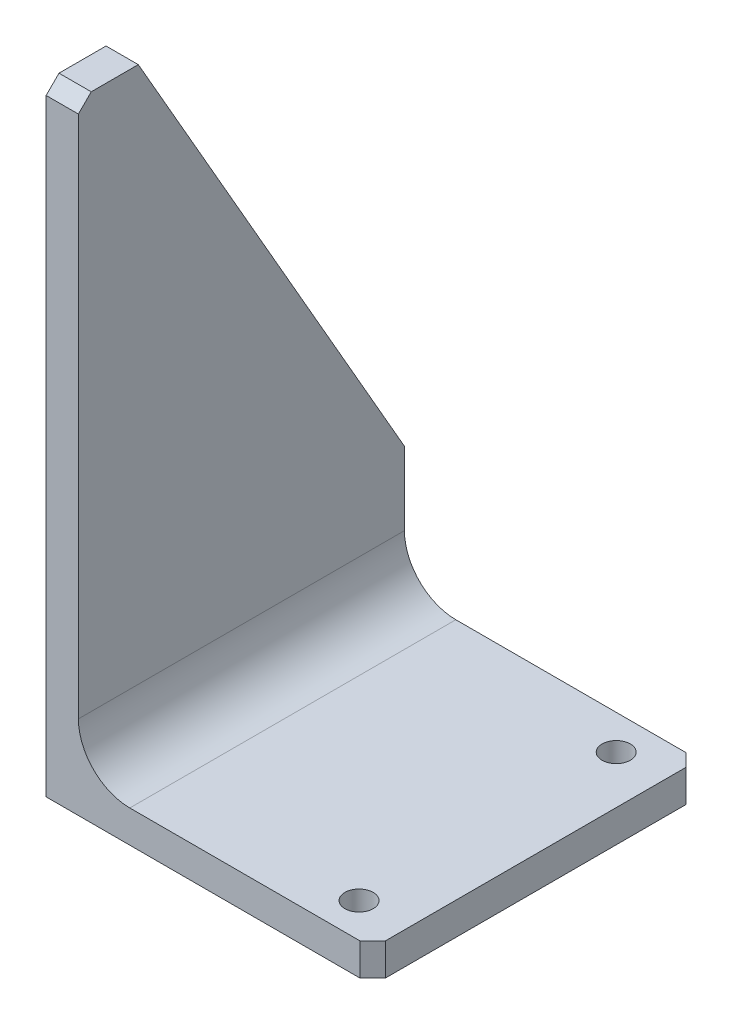
ISO-10303-21;
HEADER;
FILE_DESCRIPTION(('STEP AP214'),'2;1');
FILE_NAME('part.step','',(''),(''),'','','');
FILE_SCHEMA(('AUTOMOTIVE_DESIGN { 1 0 10303 214 1 1 1 1 }'));
ENDSEC;
DATA;
#1=APPLICATION_CONTEXT('core data for automotive mechanical design processes');
#2=APPLICATION_PROTOCOL_DEFINITION('international standard','automotive_design',2000,#1);
#3=PRODUCT_CONTEXT('',#1,'mechanical');
#4=PRODUCT('Part','Part','',(#3));
#5=PRODUCT_RELATED_PRODUCT_CATEGORY('part','',(#4));
#6=PRODUCT_DEFINITION_FORMATION('','',#4);
#7=PRODUCT_DEFINITION_CONTEXT('part definition',#1,'design');
#8=PRODUCT_DEFINITION('design','',#6,#7);
#9=PRODUCT_DEFINITION_SHAPE('','',#8);
#10=(LENGTH_UNIT() NAMED_UNIT(*) SI_UNIT(.MILLI.,.METRE.));
#11=(NAMED_UNIT(*) PLANE_ANGLE_UNIT() SI_UNIT($,.RADIAN.));
#12=(NAMED_UNIT(*) SI_UNIT($,.STERADIAN.) SOLID_ANGLE_UNIT());
#13=UNCERTAINTY_MEASURE_WITH_UNIT(LENGTH_MEASURE(1.E-05),#10,'distance_accuracy_value','');
#14=(GEOMETRIC_REPRESENTATION_CONTEXT(3) GLOBAL_UNCERTAINTY_ASSIGNED_CONTEXT((#13)) GLOBAL_UNIT_ASSIGNED_CONTEXT((#10,
#11,#12)) REPRESENTATION_CONTEXT('',''));
#15=CARTESIAN_POINT('',(0.,0.,0.));
#16=DIRECTION('',(0.,0.,1.));
#17=DIRECTION('',(1.,0.,0.));
#18=AXIS2_PLACEMENT_3D('',#15,#16,#17);
#19=CARTESIAN_POINT('',(0.,6.27,0.));
#20=DIRECTION('',(0.,1.,0.));
#21=DIRECTION('',(0.,0.,1.));
#22=AXIS2_PLACEMENT_3D('',#19,#20,#21);
#23=PLANE('',#22);
#24=CARTESIAN_POINT('',(22.39,6.27,25.));
#25=DIRECTION('',(0.,-1.,0.));
#26=DIRECTION('',(0.,0.,-1.));
#27=AXIS2_PLACEMENT_3D('',#24,#25,#26);
#28=CIRCLE('',#27,2.75);
#29=CARTESIAN_POINT('',(22.39,6.27,22.25));
#30=VERTEX_POINT('',#29);
#31=EDGE_CURVE('E157',#30,#30,#28,.T.);
#32=ORIENTED_EDGE('',*,*,#31,.T.);
#33=EDGE_LOOP('',(#32));
#34=FACE_BOUND('',#33,.T.);
#35=CARTESIAN_POINT('',(22.39,6.27,-25.));
#36=DIRECTION('',(0.,-1.,0.));
#37=DIRECTION('',(0.,0.,-1.));
#38=AXIS2_PLACEMENT_3D('',#35,#36,#37);
#39=CIRCLE('',#38,2.75);
#40=CARTESIAN_POINT('',(22.39,6.27,-27.75));
#41=VERTEX_POINT('',#40);
#42=EDGE_CURVE('E291',#41,#41,#39,.T.);
#43=ORIENTED_EDGE('',*,*,#42,.T.);
#44=EDGE_LOOP('',(#43));
#45=FACE_BOUND('',#44,.T.);
#46=DIRECTION('',(-1.,0.,0.));
#47=VECTOR('',#46,1.);
#48=CARTESIAN_POINT('',(31.74,6.27,-31.7));
#49=LINE('',#48,#47);
#50=CARTESIAN_POINT('',(29.24,6.27,-31.7));
#51=VERTEX_POINT('',#50);
#52=CARTESIAN_POINT('',(-15.49,6.27,-31.7));
#53=VERTEX_POINT('',#52);
#54=EDGE_CURVE('E170',#51,#53,#49,.T.);
#55=ORIENTED_EDGE('',*,*,#54,.T.);
#56=DIRECTION('',(0.,0.,1.));
#57=VECTOR('',#56,1.);
#58=CARTESIAN_POINT('',(-15.49,6.27,0.));
#59=LINE('',#58,#57);
#60=CARTESIAN_POINT('',(-15.49,6.27,31.7));
#61=VERTEX_POINT('',#60);
#62=EDGE_CURVE('E202',#53,#61,#59,.T.);
#63=ORIENTED_EDGE('',*,*,#62,.T.);
#64=DIRECTION('',(1.,0.,0.));
#65=VECTOR('',#64,1.);
#66=CARTESIAN_POINT('',(31.74,6.27,31.7));
#67=LINE('',#66,#65);
#68=CARTESIAN_POINT('',(29.24,6.27,31.7));
#69=VERTEX_POINT('',#68);
#70=EDGE_CURVE('E164',#61,#69,#67,.T.);
#71=ORIENTED_EDGE('',*,*,#70,.T.);
#72=DIRECTION('',(-0.707106781186548,0.,0.707106781186548));
#73=VECTOR('',#72,1.);
#74=CARTESIAN_POINT('',(30.47,6.27,30.47));
#75=LINE('',#74,#73);
#76=CARTESIAN_POINT('',(31.74,6.27,29.2));
#77=VERTEX_POINT('',#76);
#78=EDGE_CURVE('E188',#69,#77,#75,.F.);
#79=ORIENTED_EDGE('',*,*,#78,.T.);
#80=DIRECTION('',(0.,0.,-1.));
#81=VECTOR('',#80,1.);
#82=CARTESIAN_POINT('',(31.74,6.27,31.7));
#83=LINE('',#82,#81);
#84=CARTESIAN_POINT('',(31.74,6.27,-29.2));
#85=VERTEX_POINT('',#84);
#86=EDGE_CURVE('E166',#77,#85,#83,.T.);
#87=ORIENTED_EDGE('',*,*,#86,.T.);
#88=DIRECTION('',(0.707106781186548,0.,0.707106781186548));
#89=VECTOR('',#88,1.);
#90=CARTESIAN_POINT('',(30.47,6.27,-30.47));
#91=LINE('',#90,#89);
#92=EDGE_CURVE('E186',#85,#51,#91,.F.);
#93=ORIENTED_EDGE('',*,*,#92,.T.);
#94=EDGE_LOOP('',(#55,#63,#71,#79,#87,#93));
#95=FACE_BOUND('',#94,.T.);
#96=ADVANCED_FACE('F33',(#34,#45,#95),#23,.T.);
#97=CARTESIAN_POINT('',(31.74,6.27,31.7));
#98=DIRECTION('',(0.,0.,-1.));
#99=DIRECTION('',(-1.,0.,0.));
#100=AXIS2_PLACEMENT_3D('',#97,#98,#99);
#101=PLANE('',#100);
#102=ORIENTED_EDGE('',*,*,#70,.F.);
#103=CARTESIAN_POINT('',(-15.49,16.27,31.7));
#104=DIRECTION('',(0.,0.,-1.));
#105=DIRECTION('',(-1.,0.,0.));
#106=AXIS2_PLACEMENT_3D('',#103,#104,#105);
#107=CIRCLE('',#106,10.);
#108=CARTESIAN_POINT('',(-25.49,16.27,31.7));
#109=VERTEX_POINT('',#108);
#110=EDGE_CURVE('E41',#61,#109,#107,.T.);
#111=ORIENTED_EDGE('',*,*,#110,.T.);
#112=DIRECTION('',(0.,1.,0.));
#113=VECTOR('',#112,1.);
#114=CARTESIAN_POINT('',(-25.49,120.63,31.7));
#115=LINE('',#114,#113);
#116=CARTESIAN_POINT('',(-25.49,118.13,31.7));
#117=VERTEX_POINT('',#116);
#118=EDGE_CURVE('E154',#109,#117,#115,.T.);
#119=ORIENTED_EDGE('',*,*,#118,.T.);
#120=DIRECTION('',(-1.,0.,0.));
#121=VECTOR('',#120,1.);
#122=CARTESIAN_POINT('',(31.74,118.13,31.7));
#123=LINE('',#122,#121);
#124=CARTESIAN_POINT('',(-31.76,118.13,31.7));
#125=VERTEX_POINT('',#124);
#126=EDGE_CURVE('E132',#117,#125,#123,.T.);
#127=ORIENTED_EDGE('',*,*,#126,.T.);
#128=DIRECTION('',(0.,1.,0.));
#129=VECTOR('',#128,1.);
#130=CARTESIAN_POINT('',(-31.76,0.,31.7));
#131=LINE('',#130,#129);
#132=CARTESIAN_POINT('',(-31.76,0.,31.7));
#133=VERTEX_POINT('',#132);
#134=EDGE_CURVE('E129',#133,#125,#131,.T.);
#135=ORIENTED_EDGE('',*,*,#134,.F.);
#136=DIRECTION('',(1.,0.,0.));
#137=VECTOR('',#136,1.);
#138=CARTESIAN_POINT('',(31.74,0.,31.7));
#139=LINE('',#138,#137);
#140=CARTESIAN_POINT('',(29.24,0.,31.7));
#141=VERTEX_POINT('',#140);
#142=EDGE_CURVE('E115',#133,#141,#139,.T.);
#143=ORIENTED_EDGE('',*,*,#142,.T.);
#144=DIRECTION('',(0.,1.,0.));
#145=VECTOR('',#144,1.);
#146=CARTESIAN_POINT('',(29.24,6.27,31.7));
#147=LINE('',#146,#145);
#148=EDGE_CURVE('E184',#141,#69,#147,.T.);
#149=ORIENTED_EDGE('',*,*,#148,.T.);
#150=EDGE_LOOP('',(#102,#111,#119,#127,#135,#143,#149));
#151=FACE_BOUND('',#150,.T.);
#152=ADVANCED_FACE('F130',(#151),#101,.F.);
#153=CARTESIAN_POINT('',(31.74,6.27,31.7));
#154=DIRECTION('',(-1.,0.,0.));
#155=DIRECTION('',(0.,0.,1.));
#156=AXIS2_PLACEMENT_3D('',#153,#154,#155);
#157=PLANE('',#156);
#158=ORIENTED_EDGE('',*,*,#86,.F.);
#159=DIRECTION('',(0.,-1.,0.));
#160=VECTOR('',#159,1.);
#161=CARTESIAN_POINT('',(31.74,6.27,29.2));
#162=LINE('',#161,#160);
#163=CARTESIAN_POINT('',(31.74,0.,29.2));
#164=VERTEX_POINT('',#163);
#165=EDGE_CURVE('E178',#77,#164,#162,.T.);
#166=ORIENTED_EDGE('',*,*,#165,.T.);
#167=DIRECTION('',(0.,0.,-1.));
#168=VECTOR('',#167,1.);
#169=CARTESIAN_POINT('',(31.74,0.,31.7));
#170=LINE('',#169,#168);
#171=CARTESIAN_POINT('',(31.74,0.,-29.2));
#172=VERTEX_POINT('',#171);
#173=EDGE_CURVE('E125',#164,#172,#170,.T.);
#174=ORIENTED_EDGE('',*,*,#173,.T.);
#175=DIRECTION('',(0.,1.,0.));
#176=VECTOR('',#175,1.);
#177=CARTESIAN_POINT('',(31.74,6.27,-29.2));
#178=LINE('',#177,#176);
#179=EDGE_CURVE('E172',#172,#85,#178,.T.);
#180=ORIENTED_EDGE('',*,*,#179,.T.);
#181=EDGE_LOOP('',(#158,#166,#174,#180));
#182=FACE_BOUND('',#181,.T.);
#183=ADVANCED_FACE('F217',(#182),#157,.F.);
#184=CARTESIAN_POINT('',(31.74,6.27,-31.7));
#185=DIRECTION('',(0.,0.,1.));
#186=DIRECTION('',(1.,0.,0.));
#187=AXIS2_PLACEMENT_3D('',#184,#185,#186);
#188=PLANE('',#187);
#189=DIRECTION('',(-1.,0.,0.));
#190=VECTOR('',#189,1.);
#191=CARTESIAN_POINT('',(31.74,0.,-31.7));
#192=LINE('',#191,#190);
#193=CARTESIAN_POINT('',(29.24,0.,-31.7));
#194=VERTEX_POINT('',#193);
#195=CARTESIAN_POINT('',(-31.76,0.,-31.7));
#196=VERTEX_POINT('',#195);
#197=EDGE_CURVE('E167',#194,#196,#192,.T.);
#198=ORIENTED_EDGE('',*,*,#197,.T.);
#199=DIRECTION('',(0.,-1.,0.));
#200=VECTOR('',#199,1.);
#201=CARTESIAN_POINT('',(-31.76,30.5,-31.7));
#202=LINE('',#201,#200);
#203=CARTESIAN_POINT('',(-31.76,30.5,-31.7));
#204=VERTEX_POINT('',#203);
#205=EDGE_CURVE('E140',#204,#196,#202,.T.);
#206=ORIENTED_EDGE('',*,*,#205,.F.);
#207=DIRECTION('',(1.,0.,0.));
#208=VECTOR('',#207,1.);
#209=CARTESIAN_POINT('',(-31.76,30.5,-31.7));
#210=LINE('',#209,#208);
#211=CARTESIAN_POINT('',(-25.49,30.5,-31.7));
#212=VERTEX_POINT('',#211);
#213=EDGE_CURVE('E153',#204,#212,#210,.T.);
#214=ORIENTED_EDGE('',*,*,#213,.T.);
#215=DIRECTION('',(0.,-1.,0.));
#216=VECTOR('',#215,1.);
#217=CARTESIAN_POINT('',(-25.49,30.5,-31.7));
#218=LINE('',#217,#216);
#219=CARTESIAN_POINT('',(-25.49,16.27,-31.7));
#220=VERTEX_POINT('',#219);
#221=EDGE_CURVE('E141',#212,#220,#218,.T.);
#222=ORIENTED_EDGE('',*,*,#221,.T.);
#223=CARTESIAN_POINT('',(-15.49,16.27,-31.7));
#224=DIRECTION('',(0.,0.,1.));
#225=DIRECTION('',(1.,0.,0.));
#226=AXIS2_PLACEMENT_3D('',#223,#224,#225);
#227=CIRCLE('',#226,10.);
#228=EDGE_CURVE('E11',#220,#53,#227,.T.);
#229=ORIENTED_EDGE('',*,*,#228,.T.);
#230=ORIENTED_EDGE('',*,*,#54,.F.);
#231=DIRECTION('',(0.,-1.,0.));
#232=VECTOR('',#231,1.);
#233=CARTESIAN_POINT('',(29.24,6.27,-31.7));
#234=LINE('',#233,#232);
#235=EDGE_CURVE('E190',#51,#194,#234,.T.);
#236=ORIENTED_EDGE('',*,*,#235,.T.);
#237=EDGE_LOOP('',(#198,#206,#214,#222,#229,#230,#236));
#238=FACE_BOUND('',#237,.T.);
#239=ADVANCED_FACE('F223',(#238),#188,.F.);
#240=CARTESIAN_POINT('',(0.,0.,0.));
#241=DIRECTION('',(0.,1.,0.));
#242=DIRECTION('',(0.,0.,1.));
#243=AXIS2_PLACEMENT_3D('',#240,#241,#242);
#244=PLANE('',#243);
#245=CARTESIAN_POINT('',(22.39,0.,25.));
#246=DIRECTION('',(0.,-1.,0.));
#247=DIRECTION('',(0.,0.,-1.));
#248=AXIS2_PLACEMENT_3D('',#245,#246,#247);
#249=CIRCLE('',#248,2.75);
#250=CARTESIAN_POINT('',(22.39,0.,22.25));
#251=VERTEX_POINT('',#250);
#252=EDGE_CURVE('E290',#251,#251,#249,.T.);
#253=ORIENTED_EDGE('',*,*,#252,.F.);
#254=EDGE_LOOP('',(#253));
#255=FACE_BOUND('',#254,.T.);
#256=CARTESIAN_POINT('',(22.39,0.,-25.));
#257=DIRECTION('',(0.,-1.,0.));
#258=DIRECTION('',(0.,0.,-1.));
#259=AXIS2_PLACEMENT_3D('',#256,#257,#258);
#260=CIRCLE('',#259,2.75);
#261=CARTESIAN_POINT('',(22.39,0.,-27.75));
#262=VERTEX_POINT('',#261);
#263=EDGE_CURVE('E146',#262,#262,#260,.T.);
#264=ORIENTED_EDGE('',*,*,#263,.F.);
#265=EDGE_LOOP('',(#264));
#266=FACE_BOUND('',#265,.T.);
#267=DIRECTION('',(0.,0.,1.));
#268=VECTOR('',#267,1.);
#269=CARTESIAN_POINT('',(-31.76,0.,-31.7));
#270=LINE('',#269,#268);
#271=EDGE_CURVE('E120',#196,#133,#270,.T.);
#272=ORIENTED_EDGE('',*,*,#271,.F.);
#273=ORIENTED_EDGE('',*,*,#197,.F.);
#274=DIRECTION('',(-0.707106781186548,0.,-0.707106781186548));
#275=VECTOR('',#274,1.);
#276=CARTESIAN_POINT('',(29.24,0.,-31.7));
#277=LINE('',#276,#275);
#278=EDGE_CURVE('E181',#194,#172,#277,.F.);
#279=ORIENTED_EDGE('',*,*,#278,.T.);
#280=ORIENTED_EDGE('',*,*,#173,.F.);
#281=DIRECTION('',(0.707106781186548,0.,-0.707106781186548));
#282=VECTOR('',#281,1.);
#283=CARTESIAN_POINT('',(31.74,0.,29.2));
#284=LINE('',#283,#282);
#285=EDGE_CURVE('E122',#164,#141,#284,.F.);
#286=ORIENTED_EDGE('',*,*,#285,.T.);
#287=ORIENTED_EDGE('',*,*,#142,.F.);
#288=EDGE_LOOP('',(#272,#273,#279,#280,#286,#287));
#289=FACE_BOUND('',#288,.T.);
#290=ADVANCED_FACE('F117',(#255,#266,#289),#244,.F.);
#291=CARTESIAN_POINT('',(31.74,6.27,29.2));
#292=DIRECTION('',(-0.707106781186547,0.,-0.707106781186547));
#293=DIRECTION('',(0.,-1.,0.));
#294=AXIS2_PLACEMENT_3D('',#291,#292,#293);
#295=PLANE('',#294);
#296=ORIENTED_EDGE('',*,*,#78,.F.);
#297=ORIENTED_EDGE('',*,*,#148,.F.);
#298=ORIENTED_EDGE('',*,*,#285,.F.);
#299=ORIENTED_EDGE('',*,*,#165,.F.);
#300=EDGE_LOOP('',(#296,#297,#298,#299));
#301=FACE_BOUND('',#300,.T.);
#302=ADVANCED_FACE('F213',(#301),#295,.F.);
#303=CARTESIAN_POINT('',(29.24,6.27,-31.7));
#304=DIRECTION('',(-0.707106781186547,0.,0.707106781186547));
#305=DIRECTION('',(0.,-1.,0.));
#306=AXIS2_PLACEMENT_3D('',#303,#304,#305);
#307=PLANE('',#306);
#308=ORIENTED_EDGE('',*,*,#92,.F.);
#309=ORIENTED_EDGE('',*,*,#179,.F.);
#310=ORIENTED_EDGE('',*,*,#278,.F.);
#311=ORIENTED_EDGE('',*,*,#235,.F.);
#312=EDGE_LOOP('',(#308,#309,#310,#311));
#313=FACE_BOUND('',#312,.T.);
#314=ADVANCED_FACE('F220',(#313),#307,.F.);
#315=CARTESIAN_POINT('',(-31.76,120.63,31.7));
#316=DIRECTION('',(0.,-1.,0.));
#317=DIRECTION('',(0.,0.,-1.));
#318=AXIS2_PLACEMENT_3D('',#315,#316,#317);
#319=PLANE('',#318);
#320=DIRECTION('',(0.,0.,-1.));
#321=VECTOR('',#320,1.);
#322=CARTESIAN_POINT('',(-31.76,120.63,31.7));
#323=LINE('',#322,#321);
#324=CARTESIAN_POINT('',(-31.76,120.63,29.2));
#325=VERTEX_POINT('',#324);
#326=CARTESIAN_POINT('',(-31.76,120.63,20.05));
#327=VERTEX_POINT('',#326);
#328=EDGE_CURVE('E135',#325,#327,#323,.T.);
#329=ORIENTED_EDGE('',*,*,#328,.F.);
#330=DIRECTION('',(1.,0.,0.));
#331=VECTOR('',#330,1.);
#332=CARTESIAN_POINT('',(-31.76,120.63,29.2));
#333=LINE('',#332,#331);
#334=CARTESIAN_POINT('',(-25.49,120.63,29.2));
#335=VERTEX_POINT('',#334);
#336=EDGE_CURVE('E193',#325,#335,#333,.T.);
#337=ORIENTED_EDGE('',*,*,#336,.T.);
#338=DIRECTION('',(0.,0.,-1.));
#339=VECTOR('',#338,1.);
#340=CARTESIAN_POINT('',(-25.49,120.63,31.7));
#341=LINE('',#340,#339);
#342=CARTESIAN_POINT('',(-25.49,120.63,20.05));
#343=VERTEX_POINT('',#342);
#344=EDGE_CURVE('E156',#335,#343,#341,.T.);
#345=ORIENTED_EDGE('',*,*,#344,.T.);
#346=DIRECTION('',(1.,0.,0.));
#347=VECTOR('',#346,1.);
#348=CARTESIAN_POINT('',(-31.76,120.63,20.05));
#349=LINE('',#348,#347);
#350=EDGE_CURVE('E126',#327,#343,#349,.T.);
#351=ORIENTED_EDGE('',*,*,#350,.F.);
#352=EDGE_LOOP('',(#329,#337,#345,#351));
#353=FACE_BOUND('',#352,.T.);
#354=ADVANCED_FACE('F247',(#353),#319,.F.);
#355=CARTESIAN_POINT('',(-31.76,30.5,-31.7));
#356=DIRECTION('',(0.,-0.497930504714758,0.867216935071327));
#357=DIRECTION('',(0.,-0.867216935071327,-0.497930504714758));
#358=AXIS2_PLACEMENT_3D('',#355,#356,#357);
#359=PLANE('',#358);
#360=DIRECTION('',(0.,-0.867216935071327,-0.497930504714758));
#361=VECTOR('',#360,1.);
#362=CARTESIAN_POINT('',(-25.49,30.5,-31.7));
#363=LINE('',#362,#361);
#364=EDGE_CURVE('E143',#343,#212,#363,.T.);
#365=ORIENTED_EDGE('',*,*,#364,.T.);
#366=ORIENTED_EDGE('',*,*,#213,.F.);
#367=DIRECTION('',(0.,-0.867216935071327,-0.497930504714758));
#368=VECTOR('',#367,1.);
#369=CARTESIAN_POINT('',(-31.76,30.5,-31.7));
#370=LINE('',#369,#368);
#371=EDGE_CURVE('E150',#327,#204,#370,.T.);
#372=ORIENTED_EDGE('',*,*,#371,.F.);
#373=ORIENTED_EDGE('',*,*,#350,.T.);
#374=EDGE_LOOP('',(#365,#366,#372,#373));
#375=FACE_BOUND('',#374,.T.);
#376=ADVANCED_FACE('F262',(#375),#359,.F.);
#377=CARTESIAN_POINT('',(-31.76,0.,0.));
#378=DIRECTION('',(-1.,0.,0.));
#379=DIRECTION('',(0.,0.,1.));
#380=AXIS2_PLACEMENT_3D('',#377,#378,#379);
#381=PLANE('',#380);
#382=ORIENTED_EDGE('',*,*,#134,.T.);
#383=DIRECTION('',(0.,-0.707106781186548,0.707106781186548));
#384=VECTOR('',#383,1.);
#385=CARTESIAN_POINT('',(-31.76,74.915,74.915));
#386=LINE('',#385,#384);
#387=EDGE_CURVE('E200',#125,#325,#386,.F.);
#388=ORIENTED_EDGE('',*,*,#387,.T.);
#389=ORIENTED_EDGE('',*,*,#328,.T.);
#390=ORIENTED_EDGE('',*,*,#371,.T.);
#391=ORIENTED_EDGE('',*,*,#205,.T.);
#392=ORIENTED_EDGE('',*,*,#271,.T.);
#393=EDGE_LOOP('',(#382,#388,#389,#390,#391,#392));
#394=FACE_BOUND('',#393,.T.);
#395=ADVANCED_FACE('F138',(#394),#381,.T.);
#396=CARTESIAN_POINT('',(-25.49,0.,0.));
#397=DIRECTION('',(-1.,0.,0.));
#398=DIRECTION('',(0.,0.,1.));
#399=AXIS2_PLACEMENT_3D('',#396,#397,#398);
#400=PLANE('',#399);
#401=ORIENTED_EDGE('',*,*,#118,.F.);
#402=DIRECTION('',(0.,0.,1.));
#403=VECTOR('',#402,1.);
#404=CARTESIAN_POINT('',(-25.49,16.27,0.));
#405=LINE('',#404,#403);
#406=EDGE_CURVE('E48',#109,#220,#405,.F.);
#407=ORIENTED_EDGE('',*,*,#406,.T.);
#408=ORIENTED_EDGE('',*,*,#221,.F.);
#409=ORIENTED_EDGE('',*,*,#364,.F.);
#410=ORIENTED_EDGE('',*,*,#344,.F.);
#411=DIRECTION('',(0.,0.707106781186548,-0.707106781186548));
#412=VECTOR('',#411,1.);
#413=CARTESIAN_POINT('',(-25.49,120.63,29.2));
#414=LINE('',#413,#412);
#415=EDGE_CURVE('E196',#335,#117,#414,.F.);
#416=ORIENTED_EDGE('',*,*,#415,.T.);
#417=EDGE_LOOP('',(#401,#407,#408,#409,#410,#416));
#418=FACE_BOUND('',#417,.T.);
#419=ADVANCED_FACE('F234',(#418),#400,.F.);
#420=CARTESIAN_POINT('',(-31.76,120.63,29.2));
#421=DIRECTION('',(0.,-0.707106781186547,-0.707106781186547));
#422=DIRECTION('',(1.,0.,0.));
#423=AXIS2_PLACEMENT_3D('',#420,#421,#422);
#424=PLANE('',#423);
#425=ORIENTED_EDGE('',*,*,#387,.F.);
#426=ORIENTED_EDGE('',*,*,#126,.F.);
#427=ORIENTED_EDGE('',*,*,#415,.F.);
#428=ORIENTED_EDGE('',*,*,#336,.F.);
#429=EDGE_LOOP('',(#425,#426,#427,#428));
#430=FACE_BOUND('',#429,.T.);
#431=ADVANCED_FACE('F226',(#430),#424,.F.);
#432=CARTESIAN_POINT('',(-15.49,16.27,0.));
#433=DIRECTION('',(0.,0.,1.));
#434=DIRECTION('',(1.,0.,0.));
#435=AXIS2_PLACEMENT_3D('',#432,#433,#434);
#436=CYLINDRICAL_SURFACE('',#435,10.);
#437=ORIENTED_EDGE('',*,*,#228,.F.);
#438=ORIENTED_EDGE('',*,*,#406,.F.);
#439=ORIENTED_EDGE('',*,*,#110,.F.);
#440=ORIENTED_EDGE('',*,*,#62,.F.);
#441=EDGE_LOOP('',(#437,#438,#439,#440));
#442=FACE_BOUND('',#441,.T.);
#443=ADVANCED_FACE('F35',(#442),#436,.F.);
#444=CARTESIAN_POINT('',(22.39,6.27,-25.));
#445=DIRECTION('',(0.,-1.,0.));
#446=DIRECTION('',(0.,0.,-1.));
#447=AXIS2_PLACEMENT_3D('',#444,#445,#446);
#448=CYLINDRICAL_SURFACE('',#447,2.75);
#449=ORIENTED_EDGE('',*,*,#42,.F.);
#450=EDGE_LOOP('',(#449));
#451=FACE_BOUND('',#450,.T.);
#452=ORIENTED_EDGE('',*,*,#263,.T.);
#453=EDGE_LOOP('',(#452));
#454=FACE_BOUND('',#453,.T.);
#455=ADVANCED_FACE('F225',(#451,#454),#448,.F.);
#456=CARTESIAN_POINT('',(22.39,6.27,25.));
#457=DIRECTION('',(0.,-1.,0.));
#458=DIRECTION('',(0.,0.,-1.));
#459=AXIS2_PLACEMENT_3D('',#456,#457,#458);
#460=CYLINDRICAL_SURFACE('',#459,2.75);
#461=ORIENTED_EDGE('',*,*,#31,.F.);
#462=EDGE_LOOP('',(#461));
#463=FACE_BOUND('',#462,.T.);
#464=ORIENTED_EDGE('',*,*,#252,.T.);
#465=EDGE_LOOP('',(#464));
#466=FACE_BOUND('',#465,.T.);
#467=ADVANCED_FACE('F231',(#463,#466),#460,.F.);
#468=CLOSED_SHELL('',(#96,#152,#183,#239,#290,#302,#314,#354,#376,#395,#419,#431,#443,#455,#467));
#469=MANIFOLD_SOLID_BREP('B2',#468);
#470=ADVANCED_BREP_SHAPE_REPRESENTATION('',(#18,#469),#14);
#471=SHAPE_DEFINITION_REPRESENTATION(#9,#470);
ENDSEC;
END-ISO-10303-21;
